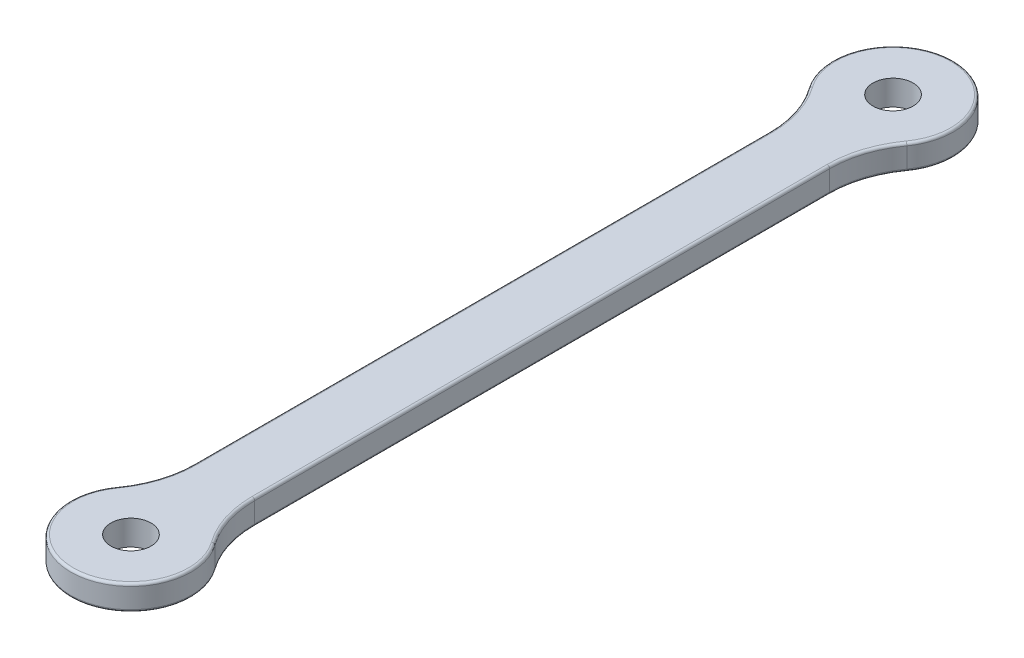
ISO-10303-21;
HEADER;
FILE_DESCRIPTION(('STEP AP214'),'2;1');
FILE_NAME('part.step','',(''),(''),'','','');
FILE_SCHEMA(('AUTOMOTIVE_DESIGN { 1 0 10303 214 1 1 1 1 }'));
ENDSEC;
DATA;
#1=APPLICATION_CONTEXT('core data for automotive mechanical design processes');
#2=APPLICATION_PROTOCOL_DEFINITION('international standard','automotive_design',2000,#1);
#3=PRODUCT_CONTEXT('',#1,'mechanical');
#4=PRODUCT('Part','Part','',(#3));
#5=PRODUCT_RELATED_PRODUCT_CATEGORY('part','',(#4));
#6=PRODUCT_DEFINITION_FORMATION('','',#4);
#7=PRODUCT_DEFINITION_CONTEXT('part definition',#1,'design');
#8=PRODUCT_DEFINITION('design','',#6,#7);
#9=PRODUCT_DEFINITION_SHAPE('','',#8);
#10=(LENGTH_UNIT() NAMED_UNIT(*) SI_UNIT(.MILLI.,.METRE.));
#11=(NAMED_UNIT(*) PLANE_ANGLE_UNIT() SI_UNIT($,.RADIAN.));
#12=(NAMED_UNIT(*) SI_UNIT($,.STERADIAN.) SOLID_ANGLE_UNIT());
#13=UNCERTAINTY_MEASURE_WITH_UNIT(LENGTH_MEASURE(1.E-05),#10,'distance_accuracy_value','');
#14=(GEOMETRIC_REPRESENTATION_CONTEXT(3) GLOBAL_UNCERTAINTY_ASSIGNED_CONTEXT((#13)) GLOBAL_UNIT_ASSIGNED_CONTEXT((#10,
#11,#12)) REPRESENTATION_CONTEXT('',''));
#15=CARTESIAN_POINT('',(0.,0.,0.));
#16=DIRECTION('',(0.,0.,1.));
#17=DIRECTION('',(1.,0.,0.));
#18=AXIS2_PLACEMENT_3D('',#15,#16,#17);
#19=CARTESIAN_POINT('',(0.,2.5,38.));
#20=DIRECTION('',(0.,-1.,0.));
#21=DIRECTION('',(0.,0.,-1.));
#22=AXIS2_PLACEMENT_3D('',#19,#20,#21);
#23=CYLINDRICAL_SURFACE('',#22,6.);
#24=DIRECTION('',(0.,-1.,0.));
#25=VECTOR('',#24,1.);
#26=CARTESIAN_POINT('',(4.87500000000001,2.5,34.5022328550917));
#27=LINE('',#26,#25);
#28=CARTESIAN_POINT('',(4.87500000000001,0.25,34.5022328550917));
#29=VERTEX_POINT('',#28);
#30=CARTESIAN_POINT('',(4.87500000000001,2.25,34.5022328550917));
#31=VERTEX_POINT('',#30);
#32=EDGE_CURVE('E301',#29,#31,#27,.F.);
#33=ORIENTED_EDGE('',*,*,#32,.T.);
#34=CARTESIAN_POINT('',(0.,2.25,38.));
#35=DIRECTION('',(0.,1.,0.));
#36=DIRECTION('',(0.,0.,1.));
#37=AXIS2_PLACEMENT_3D('',#34,#35,#36);
#38=CIRCLE('',#37,6.);
#39=CARTESIAN_POINT('',(-4.875,2.25,34.5022328550917));
#40=VERTEX_POINT('',#39);
#41=EDGE_CURVE('E195',#31,#40,#38,.F.);
#42=ORIENTED_EDGE('',*,*,#41,.T.);
#43=DIRECTION('',(0.,-1.,0.));
#44=VECTOR('',#43,1.);
#45=CARTESIAN_POINT('',(-4.875,2.5,34.5022328550917));
#46=LINE('',#45,#44);
#47=CARTESIAN_POINT('',(-4.875,0.25,34.5022328550917));
#48=VERTEX_POINT('',#47);
#49=EDGE_CURVE('E296',#40,#48,#46,.T.);
#50=ORIENTED_EDGE('',*,*,#49,.T.);
#51=CARTESIAN_POINT('',(0.,0.25,38.));
#52=DIRECTION('',(0.,1.,0.));
#53=DIRECTION('',(0.,0.,1.));
#54=AXIS2_PLACEMENT_3D('',#51,#52,#53);
#55=CIRCLE('',#54,6.);
#56=EDGE_CURVE('E193',#48,#29,#55,.T.);
#57=ORIENTED_EDGE('',*,*,#56,.T.);
#58=EDGE_LOOP('',(#33,#42,#50,#57));
#59=FACE_BOUND('',#58,.T.);
#60=ADVANCED_FACE('F41',(#59),#23,.T.);
#61=CARTESIAN_POINT('',(3.,2.5,0.));
#62=DIRECTION('',(-1.,0.,0.));
#63=DIRECTION('',(0.,0.,1.));
#64=AXIS2_PLACEMENT_3D('',#61,#62,#63);
#65=PLANE('',#64);
#66=DIRECTION('',(0.,1.,0.));
#67=VECTOR('',#66,1.);
#68=CARTESIAN_POINT('',(3.,2.5,-28.6726209469112));
#69=LINE('',#68,#67);
#70=CARTESIAN_POINT('',(3.,0.25,-28.6726209469112));
#71=VERTEX_POINT('',#70);
#72=CARTESIAN_POINT('',(3.,2.25,-28.6726209469112));
#73=VERTEX_POINT('',#72);
#74=EDGE_CURVE('E177',#71,#73,#69,.T.);
#75=ORIENTED_EDGE('',*,*,#74,.T.);
#76=DIRECTION('',(0.,0.,-1.));
#77=VECTOR('',#76,1.);
#78=CARTESIAN_POINT('',(3.,2.25,28.6726209469112));
#79=LINE('',#78,#77);
#80=CARTESIAN_POINT('',(3.,2.25,28.6726209469112));
#81=VERTEX_POINT('',#80);
#82=EDGE_CURVE('E11',#73,#81,#79,.F.);
#83=ORIENTED_EDGE('',*,*,#82,.T.);
#84=DIRECTION('',(0.,1.,0.));
#85=VECTOR('',#84,1.);
#86=CARTESIAN_POINT('',(3.,0.,28.6726209469112));
#87=LINE('',#86,#85);
#88=CARTESIAN_POINT('',(3.,0.25,28.6726209469112));
#89=VERTEX_POINT('',#88);
#90=EDGE_CURVE('E308',#81,#89,#87,.F.);
#91=ORIENTED_EDGE('',*,*,#90,.T.);
#92=DIRECTION('',(0.,0.,-1.));
#93=VECTOR('',#92,1.);
#94=CARTESIAN_POINT('',(3.,0.25,0.));
#95=LINE('',#94,#93);
#96=EDGE_CURVE('E50',#89,#71,#95,.T.);
#97=ORIENTED_EDGE('',*,*,#96,.T.);
#98=EDGE_LOOP('',(#75,#83,#91,#97));
#99=FACE_BOUND('',#98,.T.);
#100=ADVANCED_FACE('F375',(#99),#65,.F.);
#101=CARTESIAN_POINT('',(0.,2.5,-38.));
#102=DIRECTION('',(0.,-1.,0.));
#103=DIRECTION('',(0.,0.,-1.));
#104=AXIS2_PLACEMENT_3D('',#101,#102,#103);
#105=CYLINDRICAL_SURFACE('',#104,6.);
#106=DIRECTION('',(0.,-1.,0.));
#107=VECTOR('',#106,1.);
#108=CARTESIAN_POINT('',(-4.875,2.5,-34.5022328550917));
#109=LINE('',#108,#107);
#110=CARTESIAN_POINT('',(-4.875,0.25,-34.5022328550917));
#111=VERTEX_POINT('',#110);
#112=CARTESIAN_POINT('',(-4.875,2.25,-34.5022328550917));
#113=VERTEX_POINT('',#112);
#114=EDGE_CURVE('E289',#111,#113,#109,.F.);
#115=ORIENTED_EDGE('',*,*,#114,.T.);
#116=CARTESIAN_POINT('',(0.,2.25,-38.));
#117=DIRECTION('',(0.,1.,0.));
#118=DIRECTION('',(0.,0.,1.));
#119=AXIS2_PLACEMENT_3D('',#116,#117,#118);
#120=CIRCLE('',#119,6.);
#121=CARTESIAN_POINT('',(4.87500000000001,2.25,-34.5022328550917));
#122=VERTEX_POINT('',#121);
#123=EDGE_CURVE('E211',#113,#122,#120,.F.);
#124=ORIENTED_EDGE('',*,*,#123,.T.);
#125=DIRECTION('',(0.,-1.,0.));
#126=VECTOR('',#125,1.);
#127=CARTESIAN_POINT('',(4.87500000000001,2.5,-34.5022328550917));
#128=LINE('',#127,#126);
#129=CARTESIAN_POINT('',(4.87500000000001,0.25,-34.5022328550917));
#130=VERTEX_POINT('',#129);
#131=EDGE_CURVE('E298',#122,#130,#128,.T.);
#132=ORIENTED_EDGE('',*,*,#131,.T.);
#133=CARTESIAN_POINT('',(0.,0.25,-38.));
#134=DIRECTION('',(0.,1.,0.));
#135=DIRECTION('',(0.,0.,1.));
#136=AXIS2_PLACEMENT_3D('',#133,#134,#135);
#137=CIRCLE('',#136,6.);
#138=EDGE_CURVE('E209',#130,#111,#137,.T.);
#139=ORIENTED_EDGE('',*,*,#138,.T.);
#140=EDGE_LOOP('',(#115,#124,#132,#139));
#141=FACE_BOUND('',#140,.T.);
#142=ADVANCED_FACE('F381',(#141),#105,.T.);
#143=CARTESIAN_POINT('',(0.,2.5,38.));
#144=DIRECTION('',(0.,-1.,0.));
#145=DIRECTION('',(0.,0.,-1.));
#146=AXIS2_PLACEMENT_3D('',#143,#144,#145);
#147=CYLINDRICAL_SURFACE('',#146,2.);
#148=CARTESIAN_POINT('',(0.,2.5,38.));
#149=DIRECTION('',(0.,1.,0.));
#150=DIRECTION('',(0.,0.,1.));
#151=AXIS2_PLACEMENT_3D('',#148,#149,#150);
#152=CIRCLE('',#151,2.);
#153=CARTESIAN_POINT('',(0.,2.5,40.));
#154=VERTEX_POINT('',#153);
#155=EDGE_CURVE('E339',#154,#154,#152,.T.);
#156=ORIENTED_EDGE('',*,*,#155,.T.);
#157=EDGE_LOOP('',(#156));
#158=FACE_BOUND('',#157,.T.);
#159=CARTESIAN_POINT('',(0.,0.,38.));
#160=DIRECTION('',(0.,1.,0.));
#161=DIRECTION('',(0.,0.,1.));
#162=AXIS2_PLACEMENT_3D('',#159,#160,#161);
#163=CIRCLE('',#162,2.);
#164=CARTESIAN_POINT('',(0.,0.,40.));
#165=VERTEX_POINT('',#164);
#166=EDGE_CURVE('E250',#165,#165,#163,.T.);
#167=ORIENTED_EDGE('',*,*,#166,.F.);
#168=EDGE_LOOP('',(#167));
#169=FACE_BOUND('',#168,.T.);
#170=ADVANCED_FACE('F350',(#158,#169),#147,.F.);
#171=CARTESIAN_POINT('',(-3.,2.5,0.));
#172=DIRECTION('',(-1.,0.,0.));
#173=DIRECTION('',(0.,0.,1.));
#174=AXIS2_PLACEMENT_3D('',#171,#172,#173);
#175=PLANE('',#174);
#176=DIRECTION('',(0.,-1.,0.));
#177=VECTOR('',#176,1.);
#178=CARTESIAN_POINT('',(-3.,2.5,28.6726209469112));
#179=LINE('',#178,#177);
#180=CARTESIAN_POINT('',(-3.,0.25,28.6726209469112));
#181=VERTEX_POINT('',#180);
#182=CARTESIAN_POINT('',(-3.,2.25,28.6726209469112));
#183=VERTEX_POINT('',#182);
#184=EDGE_CURVE('E295',#181,#183,#179,.F.);
#185=ORIENTED_EDGE('',*,*,#184,.T.);
#186=DIRECTION('',(0.,0.,-1.));
#187=VECTOR('',#186,1.);
#188=CARTESIAN_POINT('',(-3.,2.25,0.));
#189=LINE('',#188,#187);
#190=CARTESIAN_POINT('',(-3.,2.25,-28.6726209469112));
#191=VERTEX_POINT('',#190);
#192=EDGE_CURVE('E203',#183,#191,#189,.T.);
#193=ORIENTED_EDGE('',*,*,#192,.T.);
#194=DIRECTION('',(0.,-1.,0.));
#195=VECTOR('',#194,1.);
#196=CARTESIAN_POINT('',(-3.,2.5,-28.6726209469112));
#197=LINE('',#196,#195);
#198=CARTESIAN_POINT('',(-3.,0.25,-28.6726209469112));
#199=VERTEX_POINT('',#198);
#200=EDGE_CURVE('E286',#191,#199,#197,.T.);
#201=ORIENTED_EDGE('',*,*,#200,.T.);
#202=DIRECTION('',(0.,0.,-1.));
#203=VECTOR('',#202,1.);
#204=CARTESIAN_POINT('',(-3.,0.25,28.6726209469112));
#205=LINE('',#204,#203);
#206=EDGE_CURVE('E201',#199,#181,#205,.F.);
#207=ORIENTED_EDGE('',*,*,#206,.T.);
#208=EDGE_LOOP('',(#185,#193,#201,#207));
#209=FACE_BOUND('',#208,.T.);
#210=ADVANCED_FACE('F292',(#209),#175,.T.);
#211=CARTESIAN_POINT('',(0.,2.5,-38.));
#212=DIRECTION('',(0.,-1.,0.));
#213=DIRECTION('',(0.,0.,-1.));
#214=AXIS2_PLACEMENT_3D('',#211,#212,#213);
#215=CYLINDRICAL_SURFACE('',#214,2.);
#216=CARTESIAN_POINT('',(0.,2.5,-38.));
#217=DIRECTION('',(0.,1.,0.));
#218=DIRECTION('',(0.,0.,1.));
#219=AXIS2_PLACEMENT_3D('',#216,#217,#218);
#220=CIRCLE('',#219,2.);
#221=CARTESIAN_POINT('',(0.,2.5,-36.));
#222=VERTEX_POINT('',#221);
#223=EDGE_CURVE('E337',#222,#222,#220,.T.);
#224=ORIENTED_EDGE('',*,*,#223,.T.);
#225=EDGE_LOOP('',(#224));
#226=FACE_BOUND('',#225,.T.);
#227=CARTESIAN_POINT('',(0.,0.,-38.));
#228=DIRECTION('',(0.,1.,0.));
#229=DIRECTION('',(0.,0.,1.));
#230=AXIS2_PLACEMENT_3D('',#227,#228,#229);
#231=CIRCLE('',#230,2.);
#232=CARTESIAN_POINT('',(0.,0.,-36.));
#233=VERTEX_POINT('',#232);
#234=EDGE_CURVE('E342',#233,#233,#231,.T.);
#235=ORIENTED_EDGE('',*,*,#234,.F.);
#236=EDGE_LOOP('',(#235));
#237=FACE_BOUND('',#236,.T.);
#238=ADVANCED_FACE('F355',(#226,#237),#215,.F.);
#239=CARTESIAN_POINT('',(0.,2.5,0.));
#240=DIRECTION('',(0.,1.,0.));
#241=DIRECTION('',(0.,0.,1.));
#242=AXIS2_PLACEMENT_3D('',#239,#240,#241);
#243=PLANE('',#242);
#244=CARTESIAN_POINT('',(0.,2.5,38.));
#245=DIRECTION('',(0.,1.,0.));
#246=DIRECTION('',(0.,0.,1.));
#247=AXIS2_PLACEMENT_3D('',#244,#245,#246);
#248=CIRCLE('',#247,5.75);
#249=CARTESIAN_POINT('',(-4.67187499999999,2.5,34.6479731527962));
#250=VERTEX_POINT('',#249);
#251=CARTESIAN_POINT('',(4.67187500000001,2.5,34.6479731527962));
#252=VERTEX_POINT('',#251);
#253=EDGE_CURVE('E182',#250,#252,#248,.T.);
#254=ORIENTED_EDGE('',*,*,#253,.T.);
#255=CARTESIAN_POINT('',(13.,2.5,28.6726209469112));
#256=DIRECTION('',(0.,1.,0.));
#257=DIRECTION('',(0.,0.,1.));
#258=AXIS2_PLACEMENT_3D('',#255,#256,#257);
#259=CIRCLE('',#258,10.25);
#260=CARTESIAN_POINT('',(2.75,2.5,28.6726209469112));
#261=VERTEX_POINT('',#260);
#262=EDGE_CURVE('E162',#252,#261,#259,.F.);
#263=ORIENTED_EDGE('',*,*,#262,.T.);
#264=DIRECTION('',(0.,0.,-1.));
#265=VECTOR('',#264,1.);
#266=CARTESIAN_POINT('',(2.75,2.5,-28.6726209469112));
#267=LINE('',#266,#265);
#268=CARTESIAN_POINT('',(2.75,2.5,-28.6726209469112));
#269=VERTEX_POINT('',#268);
#270=EDGE_CURVE('E170',#261,#269,#267,.T.);
#271=ORIENTED_EDGE('',*,*,#270,.T.);
#272=CARTESIAN_POINT('',(13.,2.5,-28.6726209469112));
#273=DIRECTION('',(0.,1.,0.));
#274=DIRECTION('',(0.,0.,1.));
#275=AXIS2_PLACEMENT_3D('',#272,#273,#274);
#276=CIRCLE('',#275,10.25);
#277=CARTESIAN_POINT('',(4.67187500000001,2.5,-34.6479731527962));
#278=VERTEX_POINT('',#277);
#279=EDGE_CURVE('E176',#269,#278,#276,.F.);
#280=ORIENTED_EDGE('',*,*,#279,.T.);
#281=CARTESIAN_POINT('',(0.,2.5,-38.));
#282=DIRECTION('',(0.,1.,0.));
#283=DIRECTION('',(0.,0.,1.));
#284=AXIS2_PLACEMENT_3D('',#281,#282,#283);
#285=CIRCLE('',#284,5.75);
#286=CARTESIAN_POINT('',(-4.67187499999999,2.5,-34.6479731527962));
#287=VERTEX_POINT('',#286);
#288=EDGE_CURVE('E314',#278,#287,#285,.T.);
#289=ORIENTED_EDGE('',*,*,#288,.T.);
#290=CARTESIAN_POINT('',(-13.,2.5,-28.6726209469112));
#291=DIRECTION('',(0.,1.,0.));
#292=DIRECTION('',(0.,0.,1.));
#293=AXIS2_PLACEMENT_3D('',#290,#291,#292);
#294=CIRCLE('',#293,10.25);
#295=CARTESIAN_POINT('',(-2.75,2.5,-28.6726209469112));
#296=VERTEX_POINT('',#295);
#297=EDGE_CURVE('E316',#287,#296,#294,.F.);
#298=ORIENTED_EDGE('',*,*,#297,.T.);
#299=DIRECTION('',(0.,0.,-1.));
#300=VECTOR('',#299,1.);
#301=CARTESIAN_POINT('',(-2.75,2.5,0.));
#302=LINE('',#301,#300);
#303=CARTESIAN_POINT('',(-2.75,2.5,28.6726209469112));
#304=VERTEX_POINT('',#303);
#305=EDGE_CURVE('E318',#296,#304,#302,.F.);
#306=ORIENTED_EDGE('',*,*,#305,.T.);
#307=CARTESIAN_POINT('',(-13.,2.5,28.6726209469112));
#308=DIRECTION('',(0.,1.,0.));
#309=DIRECTION('',(0.,0.,1.));
#310=AXIS2_PLACEMENT_3D('',#307,#308,#309);
#311=CIRCLE('',#310,10.25);
#312=EDGE_CURVE('E188',#304,#250,#311,.F.);
#313=ORIENTED_EDGE('',*,*,#312,.T.);
#314=EDGE_LOOP('',(#254,#263,#271,#280,#289,#298,#306,#313));
#315=FACE_BOUND('',#314,.T.);
#316=ORIENTED_EDGE('',*,*,#155,.F.);
#317=EDGE_LOOP('',(#316));
#318=FACE_BOUND('',#317,.T.);
#319=ORIENTED_EDGE('',*,*,#223,.F.);
#320=EDGE_LOOP('',(#319));
#321=FACE_BOUND('',#320,.T.);
#322=ADVANCED_FACE('F179',(#315,#318,#321),#243,.T.);
#323=CARTESIAN_POINT('',(0.,0.,0.));
#324=DIRECTION('',(0.,1.,0.));
#325=DIRECTION('',(0.,0.,1.));
#326=AXIS2_PLACEMENT_3D('',#323,#324,#325);
#327=PLANE('',#326);
#328=DIRECTION('',(0.,0.,-1.));
#329=VECTOR('',#328,1.);
#330=CARTESIAN_POINT('',(2.75,0.,0.));
#331=LINE('',#330,#329);
#332=CARTESIAN_POINT('',(2.75,0.,-28.6726209469112));
#333=VERTEX_POINT('',#332);
#334=CARTESIAN_POINT('',(2.75,0.,28.6726209469112));
#335=VERTEX_POINT('',#334);
#336=EDGE_CURVE('E217',#333,#335,#331,.F.);
#337=ORIENTED_EDGE('',*,*,#336,.T.);
#338=CARTESIAN_POINT('',(13.,0.,28.6726209469112));
#339=DIRECTION('',(0.,1.,0.));
#340=DIRECTION('',(0.,0.,1.));
#341=AXIS2_PLACEMENT_3D('',#338,#339,#340);
#342=CIRCLE('',#341,10.25);
#343=CARTESIAN_POINT('',(4.67187500000001,0.,34.6479731527962));
#344=VERTEX_POINT('',#343);
#345=EDGE_CURVE('E230',#335,#344,#342,.T.);
#346=ORIENTED_EDGE('',*,*,#345,.T.);
#347=CARTESIAN_POINT('',(0.,0.,38.));
#348=DIRECTION('',(0.,1.,0.));
#349=DIRECTION('',(0.,0.,1.));
#350=AXIS2_PLACEMENT_3D('',#347,#348,#349);
#351=CIRCLE('',#350,5.75);
#352=CARTESIAN_POINT('',(-4.67187499999999,0.,34.6479731527962));
#353=VERTEX_POINT('',#352);
#354=EDGE_CURVE('E65',#344,#353,#351,.F.);
#355=ORIENTED_EDGE('',*,*,#354,.T.);
#356=CARTESIAN_POINT('',(-13.,0.,28.6726209469112));
#357=DIRECTION('',(0.,1.,0.));
#358=DIRECTION('',(0.,0.,1.));
#359=AXIS2_PLACEMENT_3D('',#356,#357,#358);
#360=CIRCLE('',#359,10.25);
#361=CARTESIAN_POINT('',(-2.75,0.,28.6726209469112));
#362=VERTEX_POINT('',#361);
#363=EDGE_CURVE('E227',#353,#362,#360,.T.);
#364=ORIENTED_EDGE('',*,*,#363,.T.);
#365=DIRECTION('',(0.,0.,-1.));
#366=VECTOR('',#365,1.);
#367=CARTESIAN_POINT('',(-2.75,0.,-28.6726209469112));
#368=LINE('',#367,#366);
#369=CARTESIAN_POINT('',(-2.75,0.,-28.6726209469112));
#370=VERTEX_POINT('',#369);
#371=EDGE_CURVE('E225',#362,#370,#368,.T.);
#372=ORIENTED_EDGE('',*,*,#371,.T.);
#373=CARTESIAN_POINT('',(-13.,0.,-28.6726209469112));
#374=DIRECTION('',(0.,1.,0.));
#375=DIRECTION('',(0.,0.,1.));
#376=AXIS2_PLACEMENT_3D('',#373,#374,#375);
#377=CIRCLE('',#376,10.25);
#378=CARTESIAN_POINT('',(-4.67187499999999,0.,-34.6479731527962));
#379=VERTEX_POINT('',#378);
#380=EDGE_CURVE('E223',#370,#379,#377,.T.);
#381=ORIENTED_EDGE('',*,*,#380,.T.);
#382=CARTESIAN_POINT('',(0.,0.,-38.));
#383=DIRECTION('',(0.,1.,0.));
#384=DIRECTION('',(0.,0.,1.));
#385=AXIS2_PLACEMENT_3D('',#382,#383,#384);
#386=CIRCLE('',#385,5.75);
#387=CARTESIAN_POINT('',(4.671875,0.,-34.6479731527962));
#388=VERTEX_POINT('',#387);
#389=EDGE_CURVE('E221',#379,#388,#386,.F.);
#390=ORIENTED_EDGE('',*,*,#389,.T.);
#391=CARTESIAN_POINT('',(13.,0.,-28.6726209469112));
#392=DIRECTION('',(0.,1.,0.));
#393=DIRECTION('',(0.,0.,1.));
#394=AXIS2_PLACEMENT_3D('',#391,#392,#393);
#395=CIRCLE('',#394,10.25);
#396=EDGE_CURVE('E219',#388,#333,#395,.T.);
#397=ORIENTED_EDGE('',*,*,#396,.T.);
#398=EDGE_LOOP('',(#337,#346,#355,#364,#372,#381,#390,#397));
#399=FACE_BOUND('',#398,.T.);
#400=ORIENTED_EDGE('',*,*,#166,.T.);
#401=EDGE_LOOP('',(#400));
#402=FACE_BOUND('',#401,.T.);
#403=ORIENTED_EDGE('',*,*,#234,.T.);
#404=EDGE_LOOP('',(#403));
#405=FACE_BOUND('',#404,.T.);
#406=ADVANCED_FACE('F354',(#399,#402,#405),#327,.F.);
#407=CARTESIAN_POINT('',(-13.,2.5,28.6726209469112));
#408=DIRECTION('',(0.,-1.,0.));
#409=DIRECTION('',(0.,0.,-1.));
#410=AXIS2_PLACEMENT_3D('',#407,#408,#409);
#411=CYLINDRICAL_SURFACE('',#410,10.);
#412=ORIENTED_EDGE('',*,*,#49,.F.);
#413=CARTESIAN_POINT('',(-13.,2.25,28.6726209469112));
#414=DIRECTION('',(0.,1.,0.));
#415=DIRECTION('',(0.,0.,1.));
#416=AXIS2_PLACEMENT_3D('',#413,#414,#415);
#417=CIRCLE('',#416,10.);
#418=EDGE_CURVE('E199',#40,#183,#417,.T.);
#419=ORIENTED_EDGE('',*,*,#418,.T.);
#420=ORIENTED_EDGE('',*,*,#184,.F.);
#421=CARTESIAN_POINT('',(-13.,0.25,28.6726209469112));
#422=DIRECTION('',(0.,1.,0.));
#423=DIRECTION('',(0.,0.,1.));
#424=AXIS2_PLACEMENT_3D('',#421,#422,#423);
#425=CIRCLE('',#424,10.);
#426=EDGE_CURVE('E197',#181,#48,#425,.F.);
#427=ORIENTED_EDGE('',*,*,#426,.T.);
#428=EDGE_LOOP('',(#412,#419,#420,#427));
#429=FACE_BOUND('',#428,.T.);
#430=ADVANCED_FACE('F365',(#429),#411,.F.);
#431=CARTESIAN_POINT('',(-13.,2.5,-28.6726209469112));
#432=DIRECTION('',(0.,-1.,0.));
#433=DIRECTION('',(0.,0.,-1.));
#434=AXIS2_PLACEMENT_3D('',#431,#432,#433);
#435=CYLINDRICAL_SURFACE('',#434,10.);
#436=ORIENTED_EDGE('',*,*,#200,.F.);
#437=CARTESIAN_POINT('',(-13.,2.25,-28.6726209469112));
#438=DIRECTION('',(0.,1.,0.));
#439=DIRECTION('',(0.,0.,1.));
#440=AXIS2_PLACEMENT_3D('',#437,#438,#439);
#441=CIRCLE('',#440,10.);
#442=EDGE_CURVE('E207',#191,#113,#441,.T.);
#443=ORIENTED_EDGE('',*,*,#442,.T.);
#444=ORIENTED_EDGE('',*,*,#114,.F.);
#445=CARTESIAN_POINT('',(-13.,0.25,-28.6726209469112));
#446=DIRECTION('',(0.,1.,0.));
#447=DIRECTION('',(0.,0.,1.));
#448=AXIS2_PLACEMENT_3D('',#445,#446,#447);
#449=CIRCLE('',#448,10.);
#450=EDGE_CURVE('E205',#111,#199,#449,.F.);
#451=ORIENTED_EDGE('',*,*,#450,.T.);
#452=EDGE_LOOP('',(#436,#443,#444,#451));
#453=FACE_BOUND('',#452,.T.);
#454=ADVANCED_FACE('F285',(#453),#435,.F.);
#455=CARTESIAN_POINT('',(13.,2.5,-28.6726209469112));
#456=DIRECTION('',(0.,-1.,0.));
#457=DIRECTION('',(0.,0.,-1.));
#458=AXIS2_PLACEMENT_3D('',#455,#456,#457);
#459=CYLINDRICAL_SURFACE('',#458,10.);
#460=ORIENTED_EDGE('',*,*,#131,.F.);
#461=CARTESIAN_POINT('',(13.,2.25,-28.6726209469112));
#462=DIRECTION('',(0.,1.,0.));
#463=DIRECTION('',(0.,0.,1.));
#464=AXIS2_PLACEMENT_3D('',#461,#462,#463);
#465=CIRCLE('',#464,10.);
#466=EDGE_CURVE('E215',#122,#73,#465,.T.);
#467=ORIENTED_EDGE('',*,*,#466,.T.);
#468=ORIENTED_EDGE('',*,*,#74,.F.);
#469=CARTESIAN_POINT('',(13.,0.25,-28.6726209469112));
#470=DIRECTION('',(0.,1.,0.));
#471=DIRECTION('',(0.,0.,1.));
#472=AXIS2_PLACEMENT_3D('',#469,#470,#471);
#473=CIRCLE('',#472,10.);
#474=EDGE_CURVE('E213',#71,#130,#473,.F.);
#475=ORIENTED_EDGE('',*,*,#474,.T.);
#476=EDGE_LOOP('',(#460,#467,#468,#475));
#477=FACE_BOUND('',#476,.T.);
#478=ADVANCED_FACE('F388',(#477),#459,.F.);
#479=CARTESIAN_POINT('',(13.,2.5,28.6726209469112));
#480=DIRECTION('',(0.,-1.,0.));
#481=DIRECTION('',(0.,0.,-1.));
#482=AXIS2_PLACEMENT_3D('',#479,#480,#481);
#483=CYLINDRICAL_SURFACE('',#482,10.);
#484=ORIENTED_EDGE('',*,*,#90,.F.);
#485=CARTESIAN_POINT('',(13.,2.25,28.6726209469112));
#486=DIRECTION('',(0.,1.,0.));
#487=DIRECTION('',(0.,0.,1.));
#488=AXIS2_PLACEMENT_3D('',#485,#486,#487);
#489=CIRCLE('',#488,10.);
#490=EDGE_CURVE('E164',#81,#31,#489,.T.);
#491=ORIENTED_EDGE('',*,*,#490,.T.);
#492=ORIENTED_EDGE('',*,*,#32,.F.);
#493=CARTESIAN_POINT('',(13.,0.25,28.6726209469112));
#494=DIRECTION('',(0.,1.,0.));
#495=DIRECTION('',(0.,0.,1.));
#496=AXIS2_PLACEMENT_3D('',#493,#494,#495);
#497=CIRCLE('',#496,10.);
#498=EDGE_CURVE('E184',#29,#89,#497,.F.);
#499=ORIENTED_EDGE('',*,*,#498,.T.);
#500=EDGE_LOOP('',(#484,#491,#492,#499));
#501=FACE_BOUND('',#500,.T.);
#502=ADVANCED_FACE('F335',(#501),#483,.F.);
#503=CARTESIAN_POINT('',(-13.,2.25,-28.6726209469112));
#504=DIRECTION('',(0.,1.,0.));
#505=DIRECTION('',(0.,0.,1.));
#506=AXIS2_PLACEMENT_3D('',#503,#504,#505);
#507=TOROIDAL_SURFACE('',#506,10.25,0.25);
#508=CARTESIAN_POINT('',(-4.67187499999999,2.25,-34.6479731527962));
#509=DIRECTION('',(-0.582961190818049,0.,-0.812500000000001));
#510=DIRECTION('',(-0.812500000000001,0.,0.582961190818049));
#511=AXIS2_PLACEMENT_3D('',#508,#509,#510);
#512=CIRCLE('',#511,0.25);
#513=EDGE_CURVE('E244',#113,#287,#512,.T.);
#514=ORIENTED_EDGE('',*,*,#513,.F.);
#515=ORIENTED_EDGE('',*,*,#442,.F.);
#516=CARTESIAN_POINT('',(-2.75,2.25,-28.6726209469112));
#517=DIRECTION('',(0.,0.,1.));
#518=DIRECTION('',(1.,0.,0.));
#519=AXIS2_PLACEMENT_3D('',#516,#517,#518);
#520=CIRCLE('',#519,0.25);
#521=EDGE_CURVE('E247',#296,#191,#520,.T.);
#522=ORIENTED_EDGE('',*,*,#521,.F.);
#523=ORIENTED_EDGE('',*,*,#297,.F.);
#524=EDGE_LOOP('',(#514,#515,#522,#523));
#525=FACE_BOUND('',#524,.T.);
#526=ADVANCED_FACE('F394',(#525),#507,.T.);
#527=CARTESIAN_POINT('',(-2.75,2.25,0.));
#528=DIRECTION('',(0.,0.,-1.));
#529=DIRECTION('',(-1.,0.,0.));
#530=AXIS2_PLACEMENT_3D('',#527,#528,#529);
#531=CYLINDRICAL_SURFACE('',#530,0.25);
#532=ORIENTED_EDGE('',*,*,#521,.T.);
#533=ORIENTED_EDGE('',*,*,#192,.F.);
#534=CARTESIAN_POINT('',(-2.75,2.25,28.6726209469112));
#535=DIRECTION('',(0.,0.,1.));
#536=DIRECTION('',(1.,0.,0.));
#537=AXIS2_PLACEMENT_3D('',#534,#535,#536);
#538=CIRCLE('',#537,0.25);
#539=EDGE_CURVE('E241',#304,#183,#538,.T.);
#540=ORIENTED_EDGE('',*,*,#539,.F.);
#541=ORIENTED_EDGE('',*,*,#305,.F.);
#542=EDGE_LOOP('',(#532,#533,#540,#541));
#543=FACE_BOUND('',#542,.T.);
#544=ADVANCED_FACE('F410',(#543),#531,.T.);
#545=CARTESIAN_POINT('',(0.,2.25,-38.));
#546=DIRECTION('',(0.,1.,0.));
#547=DIRECTION('',(0.,0.,1.));
#548=AXIS2_PLACEMENT_3D('',#545,#546,#547);
#549=TOROIDAL_SURFACE('',#548,5.75,0.25);
#550=ORIENTED_EDGE('',*,*,#513,.T.);
#551=ORIENTED_EDGE('',*,*,#288,.F.);
#552=CARTESIAN_POINT('',(4.67187500000001,2.25,-34.6479731527962));
#553=DIRECTION('',(-0.582961190818049,0.,0.812500000000001));
#554=DIRECTION('',(0.812500000000001,0.,0.582961190818049));
#555=AXIS2_PLACEMENT_3D('',#552,#553,#554);
#556=CIRCLE('',#555,0.25);
#557=EDGE_CURVE('E238',#122,#278,#556,.T.);
#558=ORIENTED_EDGE('',*,*,#557,.F.);
#559=ORIENTED_EDGE('',*,*,#123,.F.);
#560=EDGE_LOOP('',(#550,#551,#558,#559));
#561=FACE_BOUND('',#560,.T.);
#562=ADVANCED_FACE('F407',(#561),#549,.T.);
#563=CARTESIAN_POINT('',(-13.,2.25,28.6726209469112));
#564=DIRECTION('',(0.,1.,0.));
#565=DIRECTION('',(0.,0.,1.));
#566=AXIS2_PLACEMENT_3D('',#563,#564,#565);
#567=TOROIDAL_SURFACE('',#566,10.25,0.25);
#568=ORIENTED_EDGE('',*,*,#539,.T.);
#569=ORIENTED_EDGE('',*,*,#418,.F.);
#570=CARTESIAN_POINT('',(-4.67187499999999,2.25,34.6479731527962));
#571=DIRECTION('',(-0.582961190818046,0.,0.812500000000004));
#572=DIRECTION('',(0.812500000000004,0.,0.582961190818046));
#573=AXIS2_PLACEMENT_3D('',#570,#571,#572);
#574=CIRCLE('',#573,0.25);
#575=EDGE_CURVE('E235',#250,#40,#574,.T.);
#576=ORIENTED_EDGE('',*,*,#575,.F.);
#577=ORIENTED_EDGE('',*,*,#312,.F.);
#578=EDGE_LOOP('',(#568,#569,#576,#577));
#579=FACE_BOUND('',#578,.T.);
#580=ADVANCED_FACE('F325',(#579),#567,.T.);
#581=CARTESIAN_POINT('',(13.,2.25,-28.6726209469112));
#582=DIRECTION('',(0.,1.,0.));
#583=DIRECTION('',(0.,0.,1.));
#584=AXIS2_PLACEMENT_3D('',#581,#582,#583);
#585=TOROIDAL_SURFACE('',#584,10.25,0.25);
#586=ORIENTED_EDGE('',*,*,#557,.T.);
#587=ORIENTED_EDGE('',*,*,#279,.F.);
#588=CARTESIAN_POINT('',(2.75,2.25,-28.6726209469112));
#589=DIRECTION('',(0.,0.,1.));
#590=DIRECTION('',(1.,0.,0.));
#591=AXIS2_PLACEMENT_3D('',#588,#589,#590);
#592=CIRCLE('',#591,0.25);
#593=EDGE_CURVE('E173',#73,#269,#592,.T.);
#594=ORIENTED_EDGE('',*,*,#593,.F.);
#595=ORIENTED_EDGE('',*,*,#466,.F.);
#596=EDGE_LOOP('',(#586,#587,#594,#595));
#597=FACE_BOUND('',#596,.T.);
#598=ADVANCED_FACE('F401',(#597),#585,.T.);
#599=CARTESIAN_POINT('',(0.,2.25,38.));
#600=DIRECTION('',(0.,1.,0.));
#601=DIRECTION('',(0.,0.,1.));
#602=AXIS2_PLACEMENT_3D('',#599,#600,#601);
#603=TOROIDAL_SURFACE('',#602,5.75,0.25);
#604=ORIENTED_EDGE('',*,*,#575,.T.);
#605=ORIENTED_EDGE('',*,*,#41,.F.);
#606=CARTESIAN_POINT('',(4.67187500000001,2.25,34.6479731527962));
#607=DIRECTION('',(-0.582961190818047,0.,-0.812500000000003));
#608=DIRECTION('',(-0.812500000000003,0.,0.582961190818047));
#609=AXIS2_PLACEMENT_3D('',#606,#607,#608);
#610=CIRCLE('',#609,0.25);
#611=EDGE_CURVE('E167',#252,#31,#610,.T.);
#612=ORIENTED_EDGE('',*,*,#611,.F.);
#613=ORIENTED_EDGE('',*,*,#253,.F.);
#614=EDGE_LOOP('',(#604,#605,#612,#613));
#615=FACE_BOUND('',#614,.T.);
#616=ADVANCED_FACE('F328',(#615),#603,.T.);
#617=CARTESIAN_POINT('',(2.75,2.25,0.));
#618=DIRECTION('',(0.,0.,1.));
#619=DIRECTION('',(1.,0.,0.));
#620=AXIS2_PLACEMENT_3D('',#617,#618,#619);
#621=CYLINDRICAL_SURFACE('',#620,0.25);
#622=ORIENTED_EDGE('',*,*,#593,.T.);
#623=ORIENTED_EDGE('',*,*,#270,.F.);
#624=CARTESIAN_POINT('',(2.75,2.25,28.6726209469112));
#625=DIRECTION('',(0.,0.,1.));
#626=DIRECTION('',(1.,0.,0.));
#627=AXIS2_PLACEMENT_3D('',#624,#625,#626);
#628=CIRCLE('',#627,0.25);
#629=EDGE_CURVE('E158',#81,#261,#628,.T.);
#630=ORIENTED_EDGE('',*,*,#629,.F.);
#631=ORIENTED_EDGE('',*,*,#82,.F.);
#632=EDGE_LOOP('',(#622,#623,#630,#631));
#633=FACE_BOUND('',#632,.T.);
#634=ADVANCED_FACE('F171',(#633),#621,.T.);
#635=CARTESIAN_POINT('',(13.,2.25,28.6726209469112));
#636=DIRECTION('',(0.,1.,0.));
#637=DIRECTION('',(0.,0.,1.));
#638=AXIS2_PLACEMENT_3D('',#635,#636,#637);
#639=TOROIDAL_SURFACE('',#638,10.25,0.25);
#640=ORIENTED_EDGE('',*,*,#611,.T.);
#641=ORIENTED_EDGE('',*,*,#490,.F.);
#642=ORIENTED_EDGE('',*,*,#629,.T.);
#643=ORIENTED_EDGE('',*,*,#262,.F.);
#644=EDGE_LOOP('',(#640,#641,#642,#643));
#645=FACE_BOUND('',#644,.T.);
#646=ADVANCED_FACE('F160',(#645),#639,.T.);
#647=CARTESIAN_POINT('',(-13.,0.25,-28.6726209469112));
#648=DIRECTION('',(0.,1.,0.));
#649=DIRECTION('',(0.,0.,1.));
#650=AXIS2_PLACEMENT_3D('',#647,#648,#649);
#651=TOROIDAL_SURFACE('',#650,10.25,0.25);
#652=CARTESIAN_POINT('',(-2.75,0.25,-28.6726209469112));
#653=DIRECTION('',(0.,0.,1.));
#654=DIRECTION('',(1.,0.,0.));
#655=AXIS2_PLACEMENT_3D('',#652,#653,#654);
#656=CIRCLE('',#655,0.25);
#657=EDGE_CURVE('E265',#199,#370,#656,.T.);
#658=ORIENTED_EDGE('',*,*,#657,.F.);
#659=ORIENTED_EDGE('',*,*,#450,.F.);
#660=CARTESIAN_POINT('',(-4.67187499999999,0.25,-34.6479731527962));
#661=DIRECTION('',(-0.582961190818048,0.,-0.812500000000002));
#662=DIRECTION('',(-0.812500000000002,0.,0.582961190818048));
#663=AXIS2_PLACEMENT_3D('',#660,#661,#662);
#664=CIRCLE('',#663,0.25);
#665=EDGE_CURVE('E45',#379,#111,#664,.T.);
#666=ORIENTED_EDGE('',*,*,#665,.F.);
#667=ORIENTED_EDGE('',*,*,#380,.F.);
#668=EDGE_LOOP('',(#658,#659,#666,#667));
#669=FACE_BOUND('',#668,.T.);
#670=ADVANCED_FACE('F43',(#669),#651,.T.);
#671=CARTESIAN_POINT('',(0.,0.25,-38.));
#672=DIRECTION('',(0.,1.,0.));
#673=DIRECTION('',(0.,0.,1.));
#674=AXIS2_PLACEMENT_3D('',#671,#672,#673);
#675=TOROIDAL_SURFACE('',#674,5.75,0.25);
#676=ORIENTED_EDGE('',*,*,#665,.T.);
#677=ORIENTED_EDGE('',*,*,#138,.F.);
#678=CARTESIAN_POINT('',(4.67187500000001,0.25,-34.6479731527962));
#679=DIRECTION('',(-0.582961190818049,0.,0.812500000000001));
#680=DIRECTION('',(0.812500000000001,0.,0.582961190818049));
#681=AXIS2_PLACEMENT_3D('',#678,#679,#680);
#682=CIRCLE('',#681,0.25);
#683=EDGE_CURVE('E263',#388,#130,#682,.T.);
#684=ORIENTED_EDGE('',*,*,#683,.F.);
#685=ORIENTED_EDGE('',*,*,#389,.F.);
#686=EDGE_LOOP('',(#676,#677,#684,#685));
#687=FACE_BOUND('',#686,.T.);
#688=ADVANCED_FACE('F276',(#687),#675,.T.);
#689=CARTESIAN_POINT('',(-2.75,0.25,0.));
#690=DIRECTION('',(0.,0.,1.));
#691=DIRECTION('',(1.,0.,0.));
#692=AXIS2_PLACEMENT_3D('',#689,#690,#691);
#693=CYLINDRICAL_SURFACE('',#692,0.25);
#694=ORIENTED_EDGE('',*,*,#657,.T.);
#695=ORIENTED_EDGE('',*,*,#371,.F.);
#696=CARTESIAN_POINT('',(-2.75,0.25,28.6726209469112));
#697=DIRECTION('',(0.,0.,1.));
#698=DIRECTION('',(1.,0.,0.));
#699=AXIS2_PLACEMENT_3D('',#696,#697,#698);
#700=CIRCLE('',#699,0.25);
#701=EDGE_CURVE('E260',#181,#362,#700,.T.);
#702=ORIENTED_EDGE('',*,*,#701,.F.);
#703=ORIENTED_EDGE('',*,*,#206,.F.);
#704=EDGE_LOOP('',(#694,#695,#702,#703));
#705=FACE_BOUND('',#704,.T.);
#706=ADVANCED_FACE('F436',(#705),#693,.T.);
#707=CARTESIAN_POINT('',(13.,0.25,-28.6726209469112));
#708=DIRECTION('',(0.,1.,0.));
#709=DIRECTION('',(0.,0.,1.));
#710=AXIS2_PLACEMENT_3D('',#707,#708,#709);
#711=TOROIDAL_SURFACE('',#710,10.25,0.25);
#712=ORIENTED_EDGE('',*,*,#683,.T.);
#713=ORIENTED_EDGE('',*,*,#474,.F.);
#714=CARTESIAN_POINT('',(2.75,0.25,-28.6726209469112));
#715=DIRECTION('',(0.,0.,1.));
#716=DIRECTION('',(1.,0.,0.));
#717=AXIS2_PLACEMENT_3D('',#714,#715,#716);
#718=CIRCLE('',#717,0.25);
#719=EDGE_CURVE('E257',#333,#71,#718,.T.);
#720=ORIENTED_EDGE('',*,*,#719,.F.);
#721=ORIENTED_EDGE('',*,*,#396,.F.);
#722=EDGE_LOOP('',(#712,#713,#720,#721));
#723=FACE_BOUND('',#722,.T.);
#724=ADVANCED_FACE('F432',(#723),#711,.T.);
#725=CARTESIAN_POINT('',(-13.,0.25,28.6726209469112));
#726=DIRECTION('',(0.,1.,0.));
#727=DIRECTION('',(0.,0.,1.));
#728=AXIS2_PLACEMENT_3D('',#725,#726,#727);
#729=TOROIDAL_SURFACE('',#728,10.25,0.25);
#730=ORIENTED_EDGE('',*,*,#701,.T.);
#731=ORIENTED_EDGE('',*,*,#363,.F.);
#732=CARTESIAN_POINT('',(-4.67187499999999,0.25,34.6479731527962));
#733=DIRECTION('',(-0.582961190818049,0.,0.812500000000001));
#734=DIRECTION('',(0.812500000000001,0.,0.582961190818049));
#735=AXIS2_PLACEMENT_3D('',#732,#733,#734);
#736=CIRCLE('',#735,0.25);
#737=EDGE_CURVE('E254',#48,#353,#736,.T.);
#738=ORIENTED_EDGE('',*,*,#737,.F.);
#739=ORIENTED_EDGE('',*,*,#426,.F.);
#740=EDGE_LOOP('',(#730,#731,#738,#739));
#741=FACE_BOUND('',#740,.T.);
#742=ADVANCED_FACE('F428',(#741),#729,.T.);
#743=CARTESIAN_POINT('',(2.75,0.25,0.));
#744=DIRECTION('',(0.,0.,-1.));
#745=DIRECTION('',(-1.,0.,0.));
#746=AXIS2_PLACEMENT_3D('',#743,#744,#745);
#747=CYLINDRICAL_SURFACE('',#746,0.25);
#748=ORIENTED_EDGE('',*,*,#719,.T.);
#749=ORIENTED_EDGE('',*,*,#96,.F.);
#750=CARTESIAN_POINT('',(2.75,0.25,28.6726209469112));
#751=DIRECTION('',(0.,0.,1.));
#752=DIRECTION('',(1.,0.,0.));
#753=AXIS2_PLACEMENT_3D('',#750,#751,#752);
#754=CIRCLE('',#753,0.25);
#755=EDGE_CURVE('E252',#335,#89,#754,.T.);
#756=ORIENTED_EDGE('',*,*,#755,.F.);
#757=ORIENTED_EDGE('',*,*,#336,.F.);
#758=EDGE_LOOP('',(#748,#749,#756,#757));
#759=FACE_BOUND('',#758,.T.);
#760=ADVANCED_FACE('F424',(#759),#747,.T.);
#761=CARTESIAN_POINT('',(0.,0.25,38.));
#762=DIRECTION('',(0.,1.,0.));
#763=DIRECTION('',(0.,0.,1.));
#764=AXIS2_PLACEMENT_3D('',#761,#762,#763);
#765=TOROIDAL_SURFACE('',#764,5.75,0.25);
#766=ORIENTED_EDGE('',*,*,#737,.T.);
#767=ORIENTED_EDGE('',*,*,#354,.F.);
#768=CARTESIAN_POINT('',(4.67187500000001,0.25,34.6479731527962));
#769=DIRECTION('',(-0.582961190818049,0.,-0.812500000000001));
#770=DIRECTION('',(-0.812500000000001,0.,0.582961190818049));
#771=AXIS2_PLACEMENT_3D('',#768,#769,#770);
#772=CIRCLE('',#771,0.25);
#773=EDGE_CURVE('E58',#29,#344,#772,.T.);
#774=ORIENTED_EDGE('',*,*,#773,.F.);
#775=ORIENTED_EDGE('',*,*,#56,.F.);
#776=EDGE_LOOP('',(#766,#767,#774,#775));
#777=FACE_BOUND('',#776,.T.);
#778=ADVANCED_FACE('F421',(#777),#765,.T.);
#779=CARTESIAN_POINT('',(13.,0.25,28.6726209469112));
#780=DIRECTION('',(0.,1.,0.));
#781=DIRECTION('',(0.,0.,1.));
#782=AXIS2_PLACEMENT_3D('',#779,#780,#781);
#783=TOROIDAL_SURFACE('',#782,10.25,0.25);
#784=ORIENTED_EDGE('',*,*,#755,.T.);
#785=ORIENTED_EDGE('',*,*,#498,.F.);
#786=ORIENTED_EDGE('',*,*,#773,.T.);
#787=ORIENTED_EDGE('',*,*,#345,.F.);
#788=EDGE_LOOP('',(#784,#785,#786,#787));
#789=FACE_BOUND('',#788,.T.);
#790=ADVANCED_FACE('F418',(#789),#783,.T.);
#791=CLOSED_SHELL('',(#60,#100,#142,#170,#210,#238,#322,#406,#430,#454,#478,#502,#526,#544,#562,
#580,#598,#616,#634,#646,#670,#688,#706,#724,#742,#760,#778,#790));
#792=MANIFOLD_SOLID_BREP('B2',#791);
#793=ADVANCED_BREP_SHAPE_REPRESENTATION('',(#18,#792),#14);
#794=SHAPE_DEFINITION_REPRESENTATION(#9,#793);
ENDSEC;
END-ISO-10303-21;
